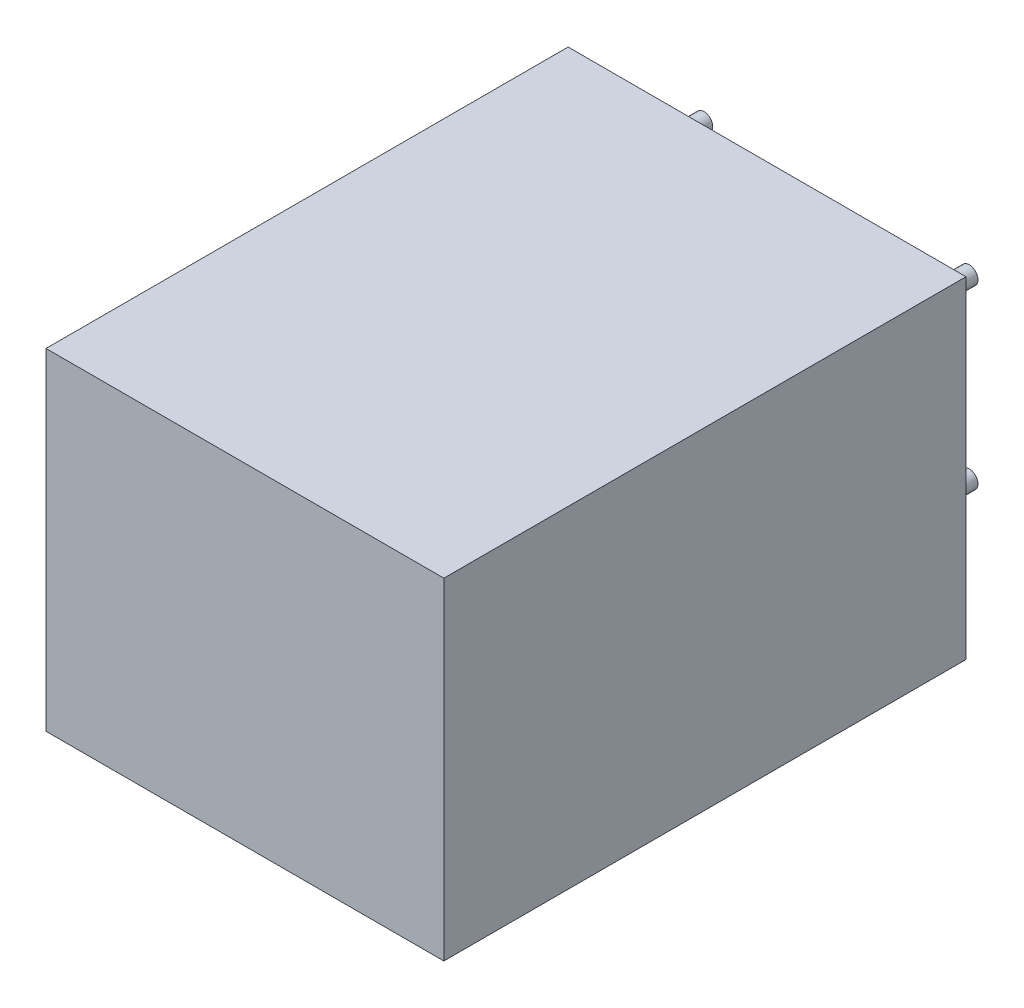
ISO-10303-21;
HEADER;
FILE_DESCRIPTION(('STEP AP214'),'2;1');
FILE_NAME('part.step','',(''),(''),'','','');
FILE_SCHEMA(('AUTOMOTIVE_DESIGN { 1 0 10303 214 1 1 1 1 }'));
ENDSEC;
DATA;
#1=APPLICATION_CONTEXT('core data for automotive mechanical design processes');
#2=APPLICATION_PROTOCOL_DEFINITION('international standard','automotive_design',2000,#1);
#3=PRODUCT_CONTEXT('',#1,'mechanical');
#4=PRODUCT('Part','Part','',(#3));
#5=PRODUCT_RELATED_PRODUCT_CATEGORY('part','',(#4));
#6=PRODUCT_DEFINITION_FORMATION('','',#4);
#7=PRODUCT_DEFINITION_CONTEXT('part definition',#1,'design');
#8=PRODUCT_DEFINITION('design','',#6,#7);
#9=PRODUCT_DEFINITION_SHAPE('','',#8);
#10=(LENGTH_UNIT() NAMED_UNIT(*) SI_UNIT(.MILLI.,.METRE.));
#11=(NAMED_UNIT(*) PLANE_ANGLE_UNIT() SI_UNIT($,.RADIAN.));
#12=(NAMED_UNIT(*) SI_UNIT($,.STERADIAN.) SOLID_ANGLE_UNIT());
#13=UNCERTAINTY_MEASURE_WITH_UNIT(LENGTH_MEASURE(1.E-05),#10,'distance_accuracy_value','');
#14=(GEOMETRIC_REPRESENTATION_CONTEXT(3) GLOBAL_UNCERTAINTY_ASSIGNED_CONTEXT((#13)) GLOBAL_UNIT_ASSIGNED_CONTEXT((#10,
#11,#12)) REPRESENTATION_CONTEXT('',''));
#15=CARTESIAN_POINT('',(0.,0.,0.));
#16=DIRECTION('',(0.,0.,1.));
#17=DIRECTION('',(1.,0.,0.));
#18=AXIS2_PLACEMENT_3D('',#15,#16,#17);
#19=CARTESIAN_POINT('',(7.62,0.,-2.));
#20=DIRECTION('',(0.,0.,1.));
#21=DIRECTION('',(1.,0.,0.));
#22=AXIS2_PLACEMENT_3D('',#19,#20,#21);
#23=CYLINDRICAL_SURFACE('',#22,0.25);
#24=CARTESIAN_POINT('',(7.62,0.,-2.));
#25=DIRECTION('',(0.,0.,1.));
#26=DIRECTION('',(1.,0.,0.));
#27=AXIS2_PLACEMENT_3D('',#24,#25,#26);
#28=CIRCLE('',#27,0.25);
#29=CARTESIAN_POINT('',(7.87,0.,-2.));
#30=VERTEX_POINT('',#29);
#31=EDGE_CURVE('E11',#30,#30,#28,.T.);
#32=ORIENTED_EDGE('',*,*,#31,.T.);
#33=EDGE_LOOP('',(#32));
#34=FACE_BOUND('',#33,.T.);
#35=CARTESIAN_POINT('',(7.62,0.,0.));
#36=DIRECTION('',(0.,0.,1.));
#37=DIRECTION('',(1.,0.,0.));
#38=AXIS2_PLACEMENT_3D('',#35,#36,#37);
#39=CIRCLE('',#38,0.25);
#40=CARTESIAN_POINT('',(7.87,0.,0.));
#41=VERTEX_POINT('',#40);
#42=EDGE_CURVE('E43',#41,#41,#39,.T.);
#43=ORIENTED_EDGE('',*,*,#42,.F.);
#44=EDGE_LOOP('',(#43));
#45=FACE_BOUND('',#44,.T.);
#46=ADVANCED_FACE('F40',(#34,#45),#23,.T.);
#47=CARTESIAN_POINT('',(7.62,0.,-2.));
#48=DIRECTION('',(0.,0.,1.));
#49=DIRECTION('',(1.,0.,0.));
#50=AXIS2_PLACEMENT_3D('',#47,#48,#49);
#51=PLANE('',#50);
#52=ORIENTED_EDGE('',*,*,#31,.F.);
#53=EDGE_LOOP('',(#52));
#54=FACE_BOUND('',#53,.T.);
#55=ADVANCED_FACE('F55',(#54),#51,.F.);
#56=CARTESIAN_POINT('',(7.62,0.,0.));
#57=DIRECTION('',(0.,0.,1.));
#58=DIRECTION('',(1.,0.,0.));
#59=AXIS2_PLACEMENT_3D('',#56,#57,#58);
#60=PLANE('',#59);
#61=ORIENTED_EDGE('',*,*,#42,.T.);
#62=EDGE_LOOP('',(#61));
#63=FACE_BOUND('',#62,.T.);
#64=ADVANCED_FACE('F52',(#63),#60,.T.);
#65=CLOSED_SHELL('',(#46,#55,#64));
#66=MANIFOLD_SOLID_BREP('B2',#65);
#67=CARTESIAN_POINT('',(7.62,5.08,-2.));
#68=DIRECTION('',(0.,0.,1.));
#69=DIRECTION('',(1.,0.,0.));
#70=AXIS2_PLACEMENT_3D('',#67,#68,#69);
#71=CYLINDRICAL_SURFACE('',#70,0.25);
#72=CARTESIAN_POINT('',(7.62,5.08,-2.));
#73=DIRECTION('',(0.,0.,1.));
#74=DIRECTION('',(1.,0.,0.));
#75=AXIS2_PLACEMENT_3D('',#72,#73,#74);
#76=CIRCLE('',#75,0.25);
#77=CARTESIAN_POINT('',(7.87,5.08,-2.));
#78=VERTEX_POINT('',#77);
#79=EDGE_CURVE('E39',#78,#78,#76,.T.);
#80=ORIENTED_EDGE('',*,*,#79,.T.);
#81=EDGE_LOOP('',(#80));
#82=FACE_BOUND('',#81,.T.);
#83=CARTESIAN_POINT('',(7.62,5.08,0.));
#84=DIRECTION('',(0.,0.,1.));
#85=DIRECTION('',(1.,0.,0.));
#86=AXIS2_PLACEMENT_3D('',#83,#84,#85);
#87=CIRCLE('',#86,0.25);
#88=CARTESIAN_POINT('',(7.87,5.08,0.));
#89=VERTEX_POINT('',#88);
#90=EDGE_CURVE('E92',#89,#89,#87,.T.);
#91=ORIENTED_EDGE('',*,*,#90,.F.);
#92=EDGE_LOOP('',(#91));
#93=FACE_BOUND('',#92,.T.);
#94=ADVANCED_FACE('F89',(#82,#93),#71,.T.);
#95=CARTESIAN_POINT('',(7.62,5.08,-2.));
#96=DIRECTION('',(0.,0.,1.));
#97=DIRECTION('',(1.,0.,0.));
#98=AXIS2_PLACEMENT_3D('',#95,#96,#97);
#99=PLANE('',#98);
#100=ORIENTED_EDGE('',*,*,#79,.F.);
#101=EDGE_LOOP('',(#100));
#102=FACE_BOUND('',#101,.T.);
#103=ADVANCED_FACE('F104',(#102),#99,.F.);
#104=CARTESIAN_POINT('',(7.62,5.08,0.));
#105=DIRECTION('',(0.,0.,1.));
#106=DIRECTION('',(1.,0.,0.));
#107=AXIS2_PLACEMENT_3D('',#104,#105,#106);
#108=PLANE('',#107);
#109=ORIENTED_EDGE('',*,*,#90,.T.);
#110=EDGE_LOOP('',(#109));
#111=FACE_BOUND('',#110,.T.);
#112=ADVANCED_FACE('F101',(#111),#108,.T.);
#113=CLOSED_SHELL('',(#94,#103,#112));
#114=MANIFOLD_SOLID_BREP('B6',#113);
#115=CARTESIAN_POINT('',(0.,5.08,-2.));
#116=DIRECTION('',(0.,0.,1.));
#117=DIRECTION('',(1.,0.,0.));
#118=AXIS2_PLACEMENT_3D('',#115,#116,#117);
#119=CYLINDRICAL_SURFACE('',#118,0.25);
#120=CARTESIAN_POINT('',(0.,5.08,-2.));
#121=DIRECTION('',(0.,0.,1.));
#122=DIRECTION('',(1.,0.,0.));
#123=AXIS2_PLACEMENT_3D('',#120,#121,#122);
#124=CIRCLE('',#123,0.25);
#125=CARTESIAN_POINT('',(0.25,5.08,-2.));
#126=VERTEX_POINT('',#125);
#127=EDGE_CURVE('E88',#126,#126,#124,.T.);
#128=ORIENTED_EDGE('',*,*,#127,.T.);
#129=EDGE_LOOP('',(#128));
#130=FACE_BOUND('',#129,.T.);
#131=CARTESIAN_POINT('',(0.,5.08,0.));
#132=DIRECTION('',(0.,0.,1.));
#133=DIRECTION('',(1.,0.,0.));
#134=AXIS2_PLACEMENT_3D('',#131,#132,#133);
#135=CIRCLE('',#134,0.25);
#136=CARTESIAN_POINT('',(0.25,5.08,0.));
#137=VERTEX_POINT('',#136);
#138=EDGE_CURVE('E141',#137,#137,#135,.T.);
#139=ORIENTED_EDGE('',*,*,#138,.F.);
#140=EDGE_LOOP('',(#139));
#141=FACE_BOUND('',#140,.T.);
#142=ADVANCED_FACE('F138',(#130,#141),#119,.T.);
#143=CARTESIAN_POINT('',(0.,5.08,-2.));
#144=DIRECTION('',(0.,0.,1.));
#145=DIRECTION('',(1.,0.,0.));
#146=AXIS2_PLACEMENT_3D('',#143,#144,#145);
#147=PLANE('',#146);
#148=ORIENTED_EDGE('',*,*,#127,.F.);
#149=EDGE_LOOP('',(#148));
#150=FACE_BOUND('',#149,.T.);
#151=ADVANCED_FACE('F153',(#150),#147,.F.);
#152=CARTESIAN_POINT('',(0.,5.08,0.));
#153=DIRECTION('',(0.,0.,1.));
#154=DIRECTION('',(1.,0.,0.));
#155=AXIS2_PLACEMENT_3D('',#152,#153,#154);
#156=PLANE('',#155);
#157=ORIENTED_EDGE('',*,*,#138,.T.);
#158=EDGE_LOOP('',(#157));
#159=FACE_BOUND('',#158,.T.);
#160=ADVANCED_FACE('F150',(#159),#156,.T.);
#161=CLOSED_SHELL('',(#142,#151,#160));
#162=MANIFOLD_SOLID_BREP('B34',#161);
#163=CARTESIAN_POINT('',(0.,0.,-2.));
#164=DIRECTION('',(0.,0.,1.));
#165=DIRECTION('',(1.,0.,0.));
#166=AXIS2_PLACEMENT_3D('',#163,#164,#165);
#167=CYLINDRICAL_SURFACE('',#166,0.25);
#168=CARTESIAN_POINT('',(0.,0.,-2.));
#169=DIRECTION('',(0.,0.,1.));
#170=DIRECTION('',(1.,0.,0.));
#171=AXIS2_PLACEMENT_3D('',#168,#169,#170);
#172=CIRCLE('',#171,0.25);
#173=CARTESIAN_POINT('',(0.25,0.,-2.));
#174=VERTEX_POINT('',#173);
#175=EDGE_CURVE('E137',#174,#174,#172,.T.);
#176=ORIENTED_EDGE('',*,*,#175,.T.);
#177=EDGE_LOOP('',(#176));
#178=FACE_BOUND('',#177,.T.);
#179=CARTESIAN_POINT('',(0.,0.,0.));
#180=DIRECTION('',(0.,0.,1.));
#181=DIRECTION('',(1.,0.,0.));
#182=AXIS2_PLACEMENT_3D('',#179,#180,#181);
#183=CIRCLE('',#182,0.25);
#184=CARTESIAN_POINT('',(0.25,0.,0.));
#185=VERTEX_POINT('',#184);
#186=EDGE_CURVE('E191',#185,#185,#183,.T.);
#187=ORIENTED_EDGE('',*,*,#186,.F.);
#188=EDGE_LOOP('',(#187));
#189=FACE_BOUND('',#188,.T.);
#190=ADVANCED_FACE('F188',(#178,#189),#167,.T.);
#191=CARTESIAN_POINT('',(0.,0.,-2.));
#192=DIRECTION('',(0.,0.,1.));
#193=DIRECTION('',(1.,0.,0.));
#194=AXIS2_PLACEMENT_3D('',#191,#192,#193);
#195=PLANE('',#194);
#196=ORIENTED_EDGE('',*,*,#175,.F.);
#197=EDGE_LOOP('',(#196));
#198=FACE_BOUND('',#197,.T.);
#199=ADVANCED_FACE('F203',(#198),#195,.F.);
#200=CARTESIAN_POINT('',(0.,0.,0.));
#201=DIRECTION('',(0.,0.,1.));
#202=DIRECTION('',(1.,0.,0.));
#203=AXIS2_PLACEMENT_3D('',#200,#201,#202);
#204=PLANE('',#203);
#205=ORIENTED_EDGE('',*,*,#186,.T.);
#206=EDGE_LOOP('',(#205));
#207=FACE_BOUND('',#206,.T.);
#208=ADVANCED_FACE('F200',(#207),#204,.T.);
#209=CLOSED_SHELL('',(#190,#199,#208));
#210=MANIFOLD_SOLID_BREP('B83',#209);
#211=CARTESIAN_POINT('',(9.525,6.985,15.));
#212=DIRECTION('',(0.,-1.,0.));
#213=DIRECTION('',(0.,0.,-1.));
#214=AXIS2_PLACEMENT_3D('',#211,#212,#213);
#215=PLANE('',#214);
#216=DIRECTION('',(-1.,0.,0.));
#217=VECTOR('',#216,1.);
#218=CARTESIAN_POINT('',(9.525,6.985,0.));
#219=LINE('',#218,#217);
#220=CARTESIAN_POINT('',(9.525,6.985,0.));
#221=VERTEX_POINT('',#220);
#222=CARTESIAN_POINT('',(-1.905,6.985,0.));
#223=VERTEX_POINT('',#222);
#224=EDGE_CURVE('E292',#221,#223,#219,.T.);
#225=ORIENTED_EDGE('',*,*,#224,.T.);
#226=DIRECTION('',(0.,0.,-1.));
#227=VECTOR('',#226,1.);
#228=CARTESIAN_POINT('',(-1.905,6.985,15.));
#229=LINE('',#228,#227);
#230=CARTESIAN_POINT('',(-1.905,6.985,15.));
#231=VERTEX_POINT('',#230);
#232=EDGE_CURVE('E186',#231,#223,#229,.T.);
#233=ORIENTED_EDGE('',*,*,#232,.F.);
#234=DIRECTION('',(-1.,0.,0.));
#235=VECTOR('',#234,1.);
#236=CARTESIAN_POINT('',(9.525,6.985,15.));
#237=LINE('',#236,#235);
#238=CARTESIAN_POINT('',(9.525,6.985,15.));
#239=VERTEX_POINT('',#238);
#240=EDGE_CURVE('E280',#239,#231,#237,.T.);
#241=ORIENTED_EDGE('',*,*,#240,.F.);
#242=DIRECTION('',(0.,0.,-1.));
#243=VECTOR('',#242,1.);
#244=CARTESIAN_POINT('',(9.525,6.985,15.));
#245=LINE('',#244,#243);
#246=EDGE_CURVE('E288',#239,#221,#245,.T.);
#247=ORIENTED_EDGE('',*,*,#246,.T.);
#248=EDGE_LOOP('',(#225,#233,#241,#247));
#249=FACE_BOUND('',#248,.T.);
#250=ADVANCED_FACE('F229',(#249),#215,.F.);
#251=CARTESIAN_POINT('',(-1.905,6.985,15.));
#252=DIRECTION('',(1.,0.,0.));
#253=DIRECTION('',(0.,0.,-1.));
#254=AXIS2_PLACEMENT_3D('',#251,#252,#253);
#255=PLANE('',#254);
#256=DIRECTION('',(0.,-1.,0.));
#257=VECTOR('',#256,1.);
#258=CARTESIAN_POINT('',(-1.905,6.985,0.));
#259=LINE('',#258,#257);
#260=CARTESIAN_POINT('',(-1.905,-2.54,0.));
#261=VERTEX_POINT('',#260);
#262=EDGE_CURVE('E284',#223,#261,#259,.T.);
#263=ORIENTED_EDGE('',*,*,#262,.T.);
#264=DIRECTION('',(0.,0.,-1.));
#265=VECTOR('',#264,1.);
#266=CARTESIAN_POINT('',(-1.905,-2.54,15.));
#267=LINE('',#266,#265);
#268=CARTESIAN_POINT('',(-1.905,-2.54,15.));
#269=VERTEX_POINT('',#268);
#270=EDGE_CURVE('E237',#269,#261,#267,.T.);
#271=ORIENTED_EDGE('',*,*,#270,.F.);
#272=DIRECTION('',(0.,-1.,0.));
#273=VECTOR('',#272,1.);
#274=CARTESIAN_POINT('',(-1.905,6.985,15.));
#275=LINE('',#274,#273);
#276=EDGE_CURVE('E275',#231,#269,#275,.T.);
#277=ORIENTED_EDGE('',*,*,#276,.F.);
#278=ORIENTED_EDGE('',*,*,#232,.T.);
#279=EDGE_LOOP('',(#263,#271,#277,#278));
#280=FACE_BOUND('',#279,.T.);
#281=ADVANCED_FACE('F283',(#280),#255,.F.);
#282=CARTESIAN_POINT('',(-1.905,-2.54,15.));
#283=DIRECTION('',(0.,1.,0.));
#284=DIRECTION('',(0.,0.,1.));
#285=AXIS2_PLACEMENT_3D('',#282,#283,#284);
#286=PLANE('',#285);
#287=DIRECTION('',(1.,0.,0.));
#288=VECTOR('',#287,1.);
#289=CARTESIAN_POINT('',(-1.905,-2.54,0.));
#290=LINE('',#289,#288);
#291=CARTESIAN_POINT('',(9.525,-2.54,0.));
#292=VERTEX_POINT('',#291);
#293=EDGE_CURVE('E262',#261,#292,#290,.T.);
#294=ORIENTED_EDGE('',*,*,#293,.T.);
#295=DIRECTION('',(0.,0.,-1.));
#296=VECTOR('',#295,1.);
#297=CARTESIAN_POINT('',(9.525,-2.54,15.));
#298=LINE('',#297,#296);
#299=CARTESIAN_POINT('',(9.525,-2.54,15.));
#300=VERTEX_POINT('',#299);
#301=EDGE_CURVE('E285',#300,#292,#298,.T.);
#302=ORIENTED_EDGE('',*,*,#301,.F.);
#303=DIRECTION('',(1.,0.,0.));
#304=VECTOR('',#303,1.);
#305=CARTESIAN_POINT('',(-1.905,-2.54,15.));
#306=LINE('',#305,#304);
#307=EDGE_CURVE('E278',#269,#300,#306,.T.);
#308=ORIENTED_EDGE('',*,*,#307,.F.);
#309=ORIENTED_EDGE('',*,*,#270,.T.);
#310=EDGE_LOOP('',(#294,#302,#308,#309));
#311=FACE_BOUND('',#310,.T.);
#312=ADVANCED_FACE('F286',(#311),#286,.F.);
#313=CARTESIAN_POINT('',(9.525,-2.54,15.));
#314=DIRECTION('',(-1.,0.,0.));
#315=DIRECTION('',(0.,0.,1.));
#316=AXIS2_PLACEMENT_3D('',#313,#314,#315);
#317=PLANE('',#316);
#318=DIRECTION('',(0.,1.,0.));
#319=VECTOR('',#318,1.);
#320=CARTESIAN_POINT('',(9.525,-2.54,0.));
#321=LINE('',#320,#319);
#322=EDGE_CURVE('E268',#292,#221,#321,.T.);
#323=ORIENTED_EDGE('',*,*,#322,.T.);
#324=ORIENTED_EDGE('',*,*,#246,.F.);
#325=DIRECTION('',(0.,1.,0.));
#326=VECTOR('',#325,1.);
#327=CARTESIAN_POINT('',(9.525,-2.54,15.));
#328=LINE('',#327,#326);
#329=EDGE_CURVE('E245',#300,#239,#328,.T.);
#330=ORIENTED_EDGE('',*,*,#329,.F.);
#331=ORIENTED_EDGE('',*,*,#301,.T.);
#332=EDGE_LOOP('',(#323,#324,#330,#331));
#333=FACE_BOUND('',#332,.T.);
#334=ADVANCED_FACE('F299',(#333),#317,.F.);
#335=CARTESIAN_POINT('',(0.,0.,15.));
#336=DIRECTION('',(0.,0.,1.));
#337=DIRECTION('',(1.,0.,0.));
#338=AXIS2_PLACEMENT_3D('',#335,#336,#337);
#339=PLANE('',#338);
#340=ORIENTED_EDGE('',*,*,#240,.T.);
#341=ORIENTED_EDGE('',*,*,#276,.T.);
#342=ORIENTED_EDGE('',*,*,#307,.T.);
#343=ORIENTED_EDGE('',*,*,#329,.T.);
#344=EDGE_LOOP('',(#340,#341,#342,#343));
#345=FACE_BOUND('',#344,.T.);
#346=ADVANCED_FACE('F276',(#345),#339,.T.);
#347=CARTESIAN_POINT('',(0.,0.,0.));
#348=DIRECTION('',(0.,0.,1.));
#349=DIRECTION('',(1.,0.,0.));
#350=AXIS2_PLACEMENT_3D('',#347,#348,#349);
#351=PLANE('',#350);
#352=ORIENTED_EDGE('',*,*,#224,.F.);
#353=ORIENTED_EDGE('',*,*,#322,.F.);
#354=ORIENTED_EDGE('',*,*,#293,.F.);
#355=ORIENTED_EDGE('',*,*,#262,.F.);
#356=EDGE_LOOP('',(#352,#353,#354,#355));
#357=FACE_BOUND('',#356,.T.);
#358=ADVANCED_FACE('F302',(#357),#351,.F.);
#359=CLOSED_SHELL('',(#250,#281,#312,#334,#346,#358));
#360=MANIFOLD_SOLID_BREP('B132',#359);
#361=ADVANCED_BREP_SHAPE_REPRESENTATION('',(#18,#66,#114,#162,#210,#360),#14);
#362=SHAPE_DEFINITION_REPRESENTATION(#9,#361);
ENDSEC;
END-ISO-10303-21;
